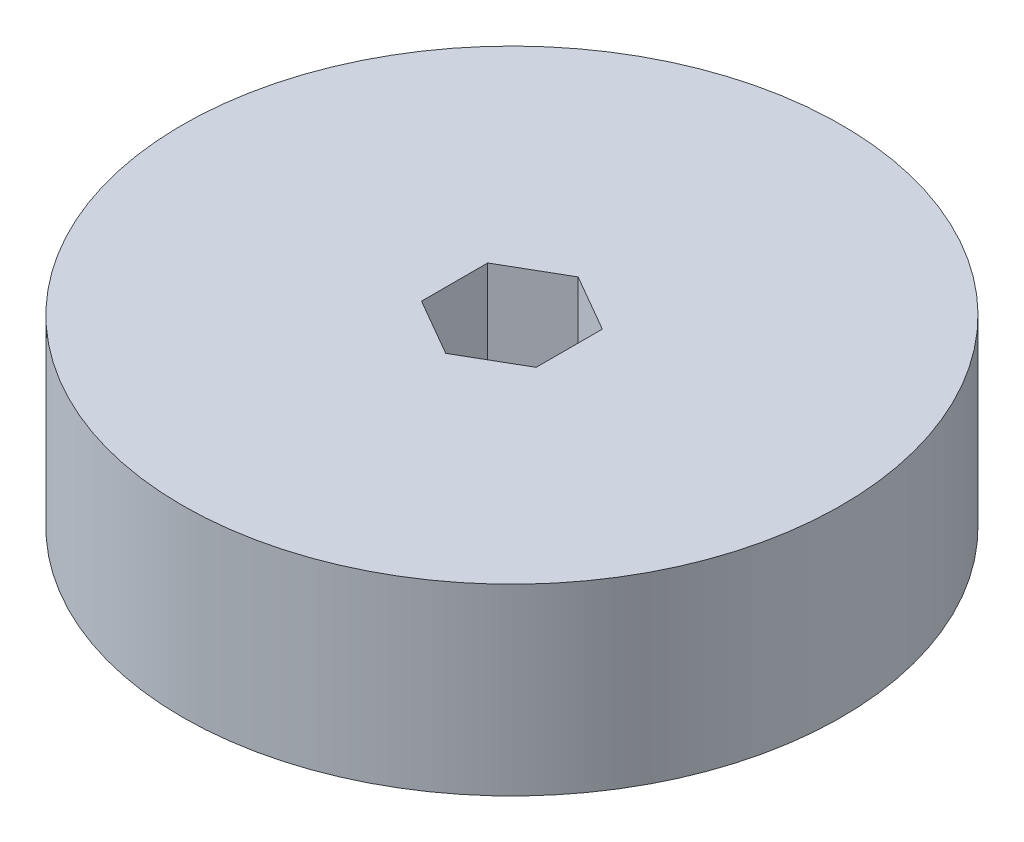
ISO-10303-21;
HEADER;
FILE_DESCRIPTION(('STEP AP214'),'2;1');
FILE_NAME('part.step','',(''),(''),'','','');
FILE_SCHEMA(('AUTOMOTIVE_DESIGN { 1 0 10303 214 1 1 1 1 }'));
ENDSEC;
DATA;
#1=APPLICATION_CONTEXT('core data for automotive mechanical design processes');
#2=APPLICATION_PROTOCOL_DEFINITION('international standard','automotive_design',2000,#1);
#3=PRODUCT_CONTEXT('',#1,'mechanical');
#4=PRODUCT('Part','Part','',(#3));
#5=PRODUCT_RELATED_PRODUCT_CATEGORY('part','',(#4));
#6=PRODUCT_DEFINITION_FORMATION('','',#4);
#7=PRODUCT_DEFINITION_CONTEXT('part definition',#1,'design');
#8=PRODUCT_DEFINITION('design','',#6,#7);
#9=PRODUCT_DEFINITION_SHAPE('','',#8);
#10=(LENGTH_UNIT() NAMED_UNIT(*) SI_UNIT(.MILLI.,.METRE.));
#11=(NAMED_UNIT(*) PLANE_ANGLE_UNIT() SI_UNIT($,.RADIAN.));
#12=(NAMED_UNIT(*) SI_UNIT($,.STERADIAN.) SOLID_ANGLE_UNIT());
#13=UNCERTAINTY_MEASURE_WITH_UNIT(LENGTH_MEASURE(1.E-05),#10,'distance_accuracy_value','');
#14=(GEOMETRIC_REPRESENTATION_CONTEXT(3) GLOBAL_UNCERTAINTY_ASSIGNED_CONTEXT((#13)) GLOBAL_UNIT_ASSIGNED_CONTEXT((#10,
#11,#12)) REPRESENTATION_CONTEXT('',''));
#15=CARTESIAN_POINT('',(0.,0.,0.));
#16=DIRECTION('',(0.,0.,1.));
#17=DIRECTION('',(1.,0.,0.));
#18=AXIS2_PLACEMENT_3D('',#15,#16,#17);
#19=CARTESIAN_POINT('',(0.,20.32,0.));
#20=DIRECTION('',(0.,1.,0.));
#21=DIRECTION('',(0.,0.,1.));
#22=AXIS2_PLACEMENT_3D('',#19,#20,#21);
#23=PLANE('',#22);
#24=CARTESIAN_POINT('',(0.,20.32,0.));
#25=DIRECTION('',(0.,1.,0.));
#26=DIRECTION('',(0.,0.,1.));
#27=AXIS2_PLACEMENT_3D('',#24,#25,#26);
#28=CIRCLE('',#27,36.5125);
#29=CARTESIAN_POINT('',(0.,20.32,36.5125));
#30=VERTEX_POINT('',#29);
#31=EDGE_CURVE('E11',#30,#30,#28,.T.);
#32=ORIENTED_EDGE('',*,*,#31,.T.);
#33=EDGE_LOOP('',(#32));
#34=FACE_BOUND('',#33,.T.);
#35=DIRECTION('',(-0.866025403784438,0.,0.5));
#36=VECTOR('',#35,1.);
#37=CARTESIAN_POINT('',(0.,20.32,-7.33234841870825));
#38=LINE('',#37,#36);
#39=CARTESIAN_POINT('',(0.,20.32,-7.33234841870825));
#40=VERTEX_POINT('',#39);
#41=CARTESIAN_POINT('',(-6.35,20.32,-3.66617420935412));
#42=VERTEX_POINT('',#41);
#43=EDGE_CURVE('E94',#40,#42,#38,.T.);
#44=ORIENTED_EDGE('',*,*,#43,.F.);
#45=DIRECTION('',(-0.866025403784439,0.,-0.5));
#46=VECTOR('',#45,1.);
#47=CARTESIAN_POINT('',(6.34999999999999,20.32,-3.66617420935413));
#48=LINE('',#47,#46);
#49=CARTESIAN_POINT('',(6.34999999999999,20.32,-3.66617420935413));
#50=VERTEX_POINT('',#49);
#51=EDGE_CURVE('E86',#50,#40,#48,.T.);
#52=ORIENTED_EDGE('',*,*,#51,.F.);
#53=DIRECTION('',(0.,0.,-1.));
#54=VECTOR('',#53,1.);
#55=CARTESIAN_POINT('',(6.34999999999999,20.32,3.66617420935412));
#56=LINE('',#55,#54);
#57=CARTESIAN_POINT('',(6.34999999999999,20.32,3.66617420935412));
#58=VERTEX_POINT('',#57);
#59=EDGE_CURVE('E114',#58,#50,#56,.T.);
#60=ORIENTED_EDGE('',*,*,#59,.F.);
#61=DIRECTION('',(0.866025403784439,0.,-0.5));
#62=VECTOR('',#61,1.);
#63=CARTESIAN_POINT('',(0.,20.32,7.33234841870824));
#64=LINE('',#63,#62);
#65=CARTESIAN_POINT('',(0.,20.32,7.33234841870824));
#66=VERTEX_POINT('',#65);
#67=EDGE_CURVE('E112',#66,#58,#64,.T.);
#68=ORIENTED_EDGE('',*,*,#67,.F.);
#69=DIRECTION('',(0.866025403784439,0.,0.5));
#70=VECTOR('',#69,1.);
#71=CARTESIAN_POINT('',(-6.34999999999999,20.32,3.66617420935412));
#72=LINE('',#71,#70);
#73=CARTESIAN_POINT('',(-6.34999999999999,20.32,3.66617420935412));
#74=VERTEX_POINT('',#73);
#75=EDGE_CURVE('E108',#74,#66,#72,.T.);
#76=ORIENTED_EDGE('',*,*,#75,.F.);
#77=DIRECTION('',(0.,0.,1.));
#78=VECTOR('',#77,1.);
#79=CARTESIAN_POINT('',(-6.35,20.32,-3.66617420935412));
#80=LINE('',#79,#78);
#81=EDGE_CURVE('E106',#42,#74,#80,.T.);
#82=ORIENTED_EDGE('',*,*,#81,.F.);
#83=EDGE_LOOP('',(#44,#52,#60,#68,#76,#82));
#84=FACE_BOUND('',#83,.T.);
#85=ADVANCED_FACE('F33',(#34,#84),#23,.T.);
#86=CARTESIAN_POINT('',(0.,0.,0.));
#87=DIRECTION('',(0.,1.,0.));
#88=DIRECTION('',(0.,0.,1.));
#89=AXIS2_PLACEMENT_3D('',#86,#87,#88);
#90=PLANE('',#89);
#91=CARTESIAN_POINT('',(0.,0.,0.));
#92=DIRECTION('',(0.,1.,0.));
#93=DIRECTION('',(0.,0.,1.));
#94=AXIS2_PLACEMENT_3D('',#91,#92,#93);
#95=CIRCLE('',#94,36.5125);
#96=CARTESIAN_POINT('',(0.,0.,36.5125));
#97=VERTEX_POINT('',#96);
#98=EDGE_CURVE('E37',#97,#97,#95,.T.);
#99=ORIENTED_EDGE('',*,*,#98,.F.);
#100=EDGE_LOOP('',(#99));
#101=FACE_BOUND('',#100,.T.);
#102=DIRECTION('',(-0.866025403784439,0.,-0.5));
#103=VECTOR('',#102,1.);
#104=CARTESIAN_POINT('',(6.34999999999999,0.,-3.66617420935413));
#105=LINE('',#104,#103);
#106=CARTESIAN_POINT('',(6.34999999999999,0.,-3.66617420935413));
#107=VERTEX_POINT('',#106);
#108=CARTESIAN_POINT('',(0.,0.,-7.33234841870825));
#109=VERTEX_POINT('',#108);
#110=EDGE_CURVE('E56',#107,#109,#105,.T.);
#111=ORIENTED_EDGE('',*,*,#110,.T.);
#112=DIRECTION('',(-0.866025403784438,0.,0.5));
#113=VECTOR('',#112,1.);
#114=CARTESIAN_POINT('',(0.,0.,-7.33234841870825));
#115=LINE('',#114,#113);
#116=CARTESIAN_POINT('',(-6.35,0.,-3.66617420935412));
#117=VERTEX_POINT('',#116);
#118=EDGE_CURVE('E101',#109,#117,#115,.T.);
#119=ORIENTED_EDGE('',*,*,#118,.T.);
#120=DIRECTION('',(0.,0.,1.));
#121=VECTOR('',#120,1.);
#122=CARTESIAN_POINT('',(-6.35,0.,-3.66617420935412));
#123=LINE('',#122,#121);
#124=CARTESIAN_POINT('',(-6.34999999999999,0.,3.66617420935412));
#125=VERTEX_POINT('',#124);
#126=EDGE_CURVE('E118',#117,#125,#123,.T.);
#127=ORIENTED_EDGE('',*,*,#126,.T.);
#128=DIRECTION('',(0.866025403784439,0.,0.5));
#129=VECTOR('',#128,1.);
#130=CARTESIAN_POINT('',(-6.34999999999999,0.,3.66617420935412));
#131=LINE('',#130,#129);
#132=CARTESIAN_POINT('',(0.,0.,7.33234841870824));
#133=VERTEX_POINT('',#132);
#134=EDGE_CURVE('E121',#125,#133,#131,.T.);
#135=ORIENTED_EDGE('',*,*,#134,.T.);
#136=DIRECTION('',(0.866025403784439,0.,-0.5));
#137=VECTOR('',#136,1.);
#138=CARTESIAN_POINT('',(0.,0.,7.33234841870824));
#139=LINE('',#138,#137);
#140=CARTESIAN_POINT('',(6.34999999999999,0.,3.66617420935412));
#141=VERTEX_POINT('',#140);
#142=EDGE_CURVE('E124',#133,#141,#139,.T.);
#143=ORIENTED_EDGE('',*,*,#142,.T.);
#144=DIRECTION('',(0.,0.,-1.));
#145=VECTOR('',#144,1.);
#146=CARTESIAN_POINT('',(6.34999999999999,0.,3.66617420935412));
#147=LINE('',#146,#145);
#148=EDGE_CURVE('E95',#141,#107,#147,.T.);
#149=ORIENTED_EDGE('',*,*,#148,.T.);
#150=EDGE_LOOP('',(#111,#119,#127,#135,#143,#149));
#151=FACE_BOUND('',#150,.T.);
#152=ADVANCED_FACE('F141',(#101,#151),#90,.F.);
#153=CARTESIAN_POINT('',(0.,20.32,0.));
#154=DIRECTION('',(0.,-1.,0.));
#155=DIRECTION('',(0.,0.,-1.));
#156=AXIS2_PLACEMENT_3D('',#153,#154,#155);
#157=CYLINDRICAL_SURFACE('',#156,36.5125);
#158=ORIENTED_EDGE('',*,*,#31,.F.);
#159=EDGE_LOOP('',(#158));
#160=FACE_BOUND('',#159,.T.);
#161=ORIENTED_EDGE('',*,*,#98,.T.);
#162=EDGE_LOOP('',(#161));
#163=FACE_BOUND('',#162,.T.);
#164=ADVANCED_FACE('F35',(#160,#163),#157,.T.);
#165=CARTESIAN_POINT('',(6.34999999999999,20.32,-3.66617420935413));
#166=DIRECTION('',(-0.5,0.,0.866025403784439));
#167=DIRECTION('',(0.866025403784439,0.,0.5));
#168=AXIS2_PLACEMENT_3D('',#165,#166,#167);
#169=PLANE('',#168);
#170=ORIENTED_EDGE('',*,*,#110,.F.);
#171=DIRECTION('',(0.,-1.,0.));
#172=VECTOR('',#171,1.);
#173=CARTESIAN_POINT('',(6.34999999999999,20.32,-3.66617420935413));
#174=LINE('',#173,#172);
#175=EDGE_CURVE('E90',#50,#107,#174,.T.);
#176=ORIENTED_EDGE('',*,*,#175,.F.);
#177=ORIENTED_EDGE('',*,*,#51,.T.);
#178=DIRECTION('',(0.,-1.,0.));
#179=VECTOR('',#178,1.);
#180=CARTESIAN_POINT('',(0.,20.32,-7.33234841870825));
#181=LINE('',#180,#179);
#182=EDGE_CURVE('E89',#40,#109,#181,.T.);
#183=ORIENTED_EDGE('',*,*,#182,.T.);
#184=EDGE_LOOP('',(#170,#176,#177,#183));
#185=FACE_BOUND('',#184,.T.);
#186=ADVANCED_FACE('F88',(#185),#169,.T.);
#187=CARTESIAN_POINT('',(0.,20.32,-7.33234841870825));
#188=DIRECTION('',(0.5,0.,0.866025403784438));
#189=DIRECTION('',(0.866025403784439,0.,-0.5));
#190=AXIS2_PLACEMENT_3D('',#187,#188,#189);
#191=PLANE('',#190);
#192=ORIENTED_EDGE('',*,*,#118,.F.);
#193=ORIENTED_EDGE('',*,*,#182,.F.);
#194=ORIENTED_EDGE('',*,*,#43,.T.);
#195=DIRECTION('',(0.,-1.,0.));
#196=VECTOR('',#195,1.);
#197=CARTESIAN_POINT('',(-6.35,20.32,-3.66617420935412));
#198=LINE('',#197,#196);
#199=EDGE_CURVE('E102',#42,#117,#198,.T.);
#200=ORIENTED_EDGE('',*,*,#199,.T.);
#201=EDGE_LOOP('',(#192,#193,#194,#200));
#202=FACE_BOUND('',#201,.T.);
#203=ADVANCED_FACE('F98',(#202),#191,.T.);
#204=CARTESIAN_POINT('',(-6.35,20.32,-3.66617420935412));
#205=DIRECTION('',(1.,0.,0.));
#206=DIRECTION('',(0.,0.,-1.));
#207=AXIS2_PLACEMENT_3D('',#204,#205,#206);
#208=PLANE('',#207);
#209=ORIENTED_EDGE('',*,*,#126,.F.);
#210=ORIENTED_EDGE('',*,*,#199,.F.);
#211=ORIENTED_EDGE('',*,*,#81,.T.);
#212=DIRECTION('',(0.,-1.,0.));
#213=VECTOR('',#212,1.);
#214=CARTESIAN_POINT('',(-6.34999999999999,20.32,3.66617420935412));
#215=LINE('',#214,#213);
#216=EDGE_CURVE('E133',#74,#125,#215,.T.);
#217=ORIENTED_EDGE('',*,*,#216,.T.);
#218=EDGE_LOOP('',(#209,#210,#211,#217));
#219=FACE_BOUND('',#218,.T.);
#220=ADVANCED_FACE('F137',(#219),#208,.T.);
#221=CARTESIAN_POINT('',(-6.34999999999999,20.32,3.66617420935412));
#222=DIRECTION('',(0.5,0.,-0.866025403784439));
#223=DIRECTION('',(-0.866025403784439,0.,-0.5));
#224=AXIS2_PLACEMENT_3D('',#221,#222,#223);
#225=PLANE('',#224);
#226=ORIENTED_EDGE('',*,*,#134,.F.);
#227=ORIENTED_EDGE('',*,*,#216,.F.);
#228=ORIENTED_EDGE('',*,*,#75,.T.);
#229=DIRECTION('',(0.,-1.,0.));
#230=VECTOR('',#229,1.);
#231=CARTESIAN_POINT('',(0.,20.32,7.33234841870824));
#232=LINE('',#231,#230);
#233=EDGE_CURVE('E131',#66,#133,#232,.T.);
#234=ORIENTED_EDGE('',*,*,#233,.T.);
#235=EDGE_LOOP('',(#226,#227,#228,#234));
#236=FACE_BOUND('',#235,.T.);
#237=ADVANCED_FACE('F149',(#236),#225,.T.);
#238=CARTESIAN_POINT('',(0.,20.32,7.33234841870824));
#239=DIRECTION('',(-0.5,0.,-0.866025403784439));
#240=DIRECTION('',(-0.866025403784439,0.,0.5));
#241=AXIS2_PLACEMENT_3D('',#238,#239,#240);
#242=PLANE('',#241);
#243=ORIENTED_EDGE('',*,*,#142,.F.);
#244=ORIENTED_EDGE('',*,*,#233,.F.);
#245=ORIENTED_EDGE('',*,*,#67,.T.);
#246=DIRECTION('',(0.,-1.,0.));
#247=VECTOR('',#246,1.);
#248=CARTESIAN_POINT('',(6.34999999999999,20.32,3.66617420935412));
#249=LINE('',#248,#247);
#250=EDGE_CURVE('E48',#58,#141,#249,.T.);
#251=ORIENTED_EDGE('',*,*,#250,.T.);
#252=EDGE_LOOP('',(#243,#244,#245,#251));
#253=FACE_BOUND('',#252,.T.);
#254=ADVANCED_FACE('F147',(#253),#242,.T.);
#255=CARTESIAN_POINT('',(6.34999999999999,20.32,3.66617420935412));
#256=DIRECTION('',(-1.,0.,0.));
#257=DIRECTION('',(0.,0.,1.));
#258=AXIS2_PLACEMENT_3D('',#255,#256,#257);
#259=PLANE('',#258);
#260=ORIENTED_EDGE('',*,*,#148,.F.);
#261=ORIENTED_EDGE('',*,*,#250,.F.);
#262=ORIENTED_EDGE('',*,*,#59,.T.);
#263=ORIENTED_EDGE('',*,*,#175,.T.);
#264=EDGE_LOOP('',(#260,#261,#262,#263));
#265=FACE_BOUND('',#264,.T.);
#266=ADVANCED_FACE('F143',(#265),#259,.T.);
#267=CLOSED_SHELL('',(#85,#152,#164,#186,#203,#220,#237,#254,#266));
#268=MANIFOLD_SOLID_BREP('B2',#267);
#269=ADVANCED_BREP_SHAPE_REPRESENTATION('',(#18,#268),#14);
#270=SHAPE_DEFINITION_REPRESENTATION(#9,#269);
ENDSEC;
END-ISO-10303-21;
